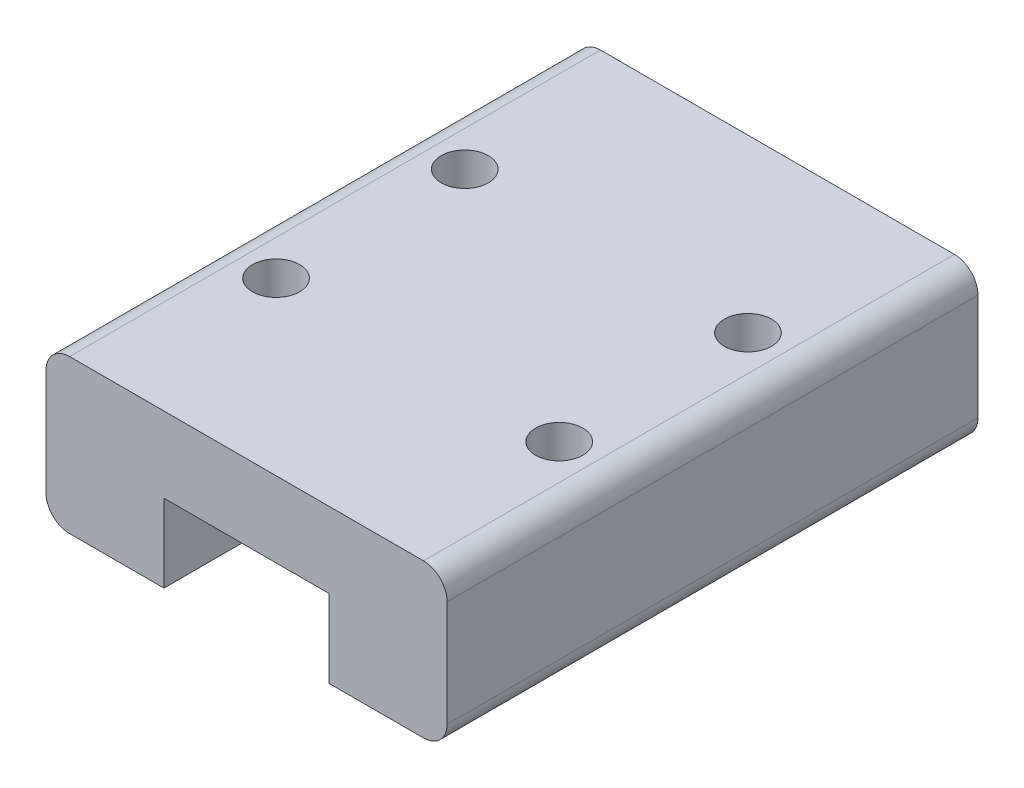
ISO-10303-21;
HEADER;
FILE_DESCRIPTION(('STEP AP214'),'2;1');
FILE_NAME('part.step','',(''),(''),'','','');
FILE_SCHEMA(('AUTOMOTIVE_DESIGN { 1 0 10303 214 1 1 1 1 }'));
ENDSEC;
DATA;
#1=APPLICATION_CONTEXT('core data for automotive mechanical design processes');
#2=APPLICATION_PROTOCOL_DEFINITION('international standard','automotive_design',2000,#1);
#3=PRODUCT_CONTEXT('',#1,'mechanical');
#4=PRODUCT('Part','Part','',(#3));
#5=PRODUCT_RELATED_PRODUCT_CATEGORY('part','',(#4));
#6=PRODUCT_DEFINITION_FORMATION('','',#4);
#7=PRODUCT_DEFINITION_CONTEXT('part definition',#1,'design');
#8=PRODUCT_DEFINITION('design','',#6,#7);
#9=PRODUCT_DEFINITION_SHAPE('','',#8);
#10=(LENGTH_UNIT() NAMED_UNIT(*) SI_UNIT(.MILLI.,.METRE.));
#11=(NAMED_UNIT(*) PLANE_ANGLE_UNIT() SI_UNIT($,.RADIAN.));
#12=(NAMED_UNIT(*) SI_UNIT($,.STERADIAN.) SOLID_ANGLE_UNIT());
#13=UNCERTAINTY_MEASURE_WITH_UNIT(LENGTH_MEASURE(1.E-05),#10,'distance_accuracy_value','');
#14=(GEOMETRIC_REPRESENTATION_CONTEXT(3) GLOBAL_UNCERTAINTY_ASSIGNED_CONTEXT((#13)) GLOBAL_UNIT_ASSIGNED_CONTEXT((#10,
#11,#12)) REPRESENTATION_CONTEXT('',''));
#15=CARTESIAN_POINT('',(0.,0.,0.));
#16=DIRECTION('',(0.,0.,1.));
#17=DIRECTION('',(1.,0.,0.));
#18=AXIS2_PLACEMENT_3D('',#15,#16,#17);
#19=CARTESIAN_POINT('',(5.,0.,22.5));
#20=DIRECTION('',(-1.,0.,0.));
#21=DIRECTION('',(0.,0.,1.));
#22=AXIS2_PLACEMENT_3D('',#19,#20,#21);
#23=PLANE('',#22);
#24=DIRECTION('',(0.,1.,0.));
#25=VECTOR('',#24,1.);
#26=CARTESIAN_POINT('',(5.,0.,0.));
#27=LINE('',#26,#25);
#28=CARTESIAN_POINT('',(5.,0.,0.));
#29=VERTEX_POINT('',#28);
#30=CARTESIAN_POINT('',(5.,3.3,0.));
#31=VERTEX_POINT('',#30);
#32=EDGE_CURVE('E154',#29,#31,#27,.T.);
#33=ORIENTED_EDGE('',*,*,#32,.T.);
#34=DIRECTION('',(0.,0.,-1.));
#35=VECTOR('',#34,1.);
#36=CARTESIAN_POINT('',(5.,3.3,22.5));
#37=LINE('',#36,#35);
#38=CARTESIAN_POINT('',(5.,3.3,22.5));
#39=VERTEX_POINT('',#38);
#40=EDGE_CURVE('E11',#39,#31,#37,.T.);
#41=ORIENTED_EDGE('',*,*,#40,.F.);
#42=DIRECTION('',(0.,1.,0.));
#43=VECTOR('',#42,1.);
#44=CARTESIAN_POINT('',(5.,0.,22.5));
#45=LINE('',#44,#43);
#46=CARTESIAN_POINT('',(5.,0.,22.5));
#47=VERTEX_POINT('',#46);
#48=EDGE_CURVE('E177',#47,#39,#45,.T.);
#49=ORIENTED_EDGE('',*,*,#48,.F.);
#50=DIRECTION('',(0.,0.,-1.));
#51=VECTOR('',#50,1.);
#52=CARTESIAN_POINT('',(5.,0.,22.5));
#53=LINE('',#52,#51);
#54=EDGE_CURVE('E150',#47,#29,#53,.T.);
#55=ORIENTED_EDGE('',*,*,#54,.T.);
#56=EDGE_LOOP('',(#33,#41,#49,#55));
#57=FACE_BOUND('',#56,.T.);
#58=ADVANCED_FACE('F34',(#57),#23,.F.);
#59=CARTESIAN_POINT('',(5.,3.3,22.5));
#60=DIRECTION('',(0.,1.,0.));
#61=DIRECTION('',(0.,0.,1.));
#62=AXIS2_PLACEMENT_3D('',#59,#60,#61);
#63=PLANE('',#62);
#64=DIRECTION('',(1.,0.,0.));
#65=VECTOR('',#64,1.);
#66=CARTESIAN_POINT('',(5.,3.3,0.));
#67=LINE('',#66,#65);
#68=CARTESIAN_POINT('',(12.,3.3,0.));
#69=VERTEX_POINT('',#68);
#70=EDGE_CURVE('E157',#31,#69,#67,.T.);
#71=ORIENTED_EDGE('',*,*,#70,.T.);
#72=DIRECTION('',(0.,0.,-1.));
#73=VECTOR('',#72,1.);
#74=CARTESIAN_POINT('',(12.,3.3,22.5));
#75=LINE('',#74,#73);
#76=CARTESIAN_POINT('',(12.,3.3,22.5));
#77=VERTEX_POINT('',#76);
#78=EDGE_CURVE('E42',#77,#69,#75,.T.);
#79=ORIENTED_EDGE('',*,*,#78,.F.);
#80=DIRECTION('',(1.,0.,0.));
#81=VECTOR('',#80,1.);
#82=CARTESIAN_POINT('',(5.,3.3,22.5));
#83=LINE('',#82,#81);
#84=EDGE_CURVE('E105',#39,#77,#83,.T.);
#85=ORIENTED_EDGE('',*,*,#84,.F.);
#86=ORIENTED_EDGE('',*,*,#40,.T.);
#87=EDGE_LOOP('',(#71,#79,#85,#86));
#88=FACE_BOUND('',#87,.T.);
#89=ADVANCED_FACE('F255',(#88),#63,.F.);
#90=CARTESIAN_POINT('',(12.,0.,22.5));
#91=DIRECTION('',(1.,0.,0.));
#92=DIRECTION('',(0.,0.,-1.));
#93=AXIS2_PLACEMENT_3D('',#90,#91,#92);
#94=PLANE('',#93);
#95=DIRECTION('',(0.,-1.,0.));
#96=VECTOR('',#95,1.);
#97=CARTESIAN_POINT('',(12.,0.,0.));
#98=LINE('',#97,#96);
#99=CARTESIAN_POINT('',(12.,0.,0.));
#100=VERTEX_POINT('',#99);
#101=EDGE_CURVE('E160',#69,#100,#98,.T.);
#102=ORIENTED_EDGE('',*,*,#101,.T.);
#103=DIRECTION('',(0.,0.,-1.));
#104=VECTOR('',#103,1.);
#105=CARTESIAN_POINT('',(12.,0.,22.5));
#106=LINE('',#105,#104);
#107=CARTESIAN_POINT('',(12.,0.,22.5));
#108=VERTEX_POINT('',#107);
#109=EDGE_CURVE('E196',#108,#100,#106,.T.);
#110=ORIENTED_EDGE('',*,*,#109,.F.);
#111=DIRECTION('',(0.,-1.,0.));
#112=VECTOR('',#111,1.);
#113=CARTESIAN_POINT('',(12.,0.,22.5));
#114=LINE('',#113,#112);
#115=EDGE_CURVE('E204',#77,#108,#114,.T.);
#116=ORIENTED_EDGE('',*,*,#115,.F.);
#117=ORIENTED_EDGE('',*,*,#78,.T.);
#118=EDGE_LOOP('',(#102,#110,#116,#117));
#119=FACE_BOUND('',#118,.T.);
#120=ADVANCED_FACE('F202',(#119),#94,.F.);
#121=CARTESIAN_POINT('',(12.,0.,22.5));
#122=DIRECTION('',(0.,1.,0.));
#123=DIRECTION('',(0.,0.,1.));
#124=AXIS2_PLACEMENT_3D('',#121,#122,#123);
#125=PLANE('',#124);
#126=DIRECTION('',(1.,0.,0.));
#127=VECTOR('',#126,1.);
#128=CARTESIAN_POINT('',(12.,0.,0.));
#129=LINE('',#128,#127);
#130=CARTESIAN_POINT('',(16.,0.,0.));
#131=VERTEX_POINT('',#130);
#132=EDGE_CURVE('E162',#100,#131,#129,.T.);
#133=ORIENTED_EDGE('',*,*,#132,.T.);
#134=DIRECTION('',(0.,0.,-1.));
#135=VECTOR('',#134,1.);
#136=CARTESIAN_POINT('',(16.,0.,22.5));
#137=LINE('',#136,#135);
#138=CARTESIAN_POINT('',(16.,0.,22.5));
#139=VERTEX_POINT('',#138);
#140=EDGE_CURVE('E193',#139,#131,#137,.T.);
#141=ORIENTED_EDGE('',*,*,#140,.F.);
#142=DIRECTION('',(1.,0.,0.));
#143=VECTOR('',#142,1.);
#144=CARTESIAN_POINT('',(12.,0.,22.5));
#145=LINE('',#144,#143);
#146=EDGE_CURVE('E222',#108,#139,#145,.T.);
#147=ORIENTED_EDGE('',*,*,#146,.F.);
#148=ORIENTED_EDGE('',*,*,#109,.T.);
#149=EDGE_LOOP('',(#133,#141,#147,#148));
#150=FACE_BOUND('',#149,.T.);
#151=ADVANCED_FACE('F213',(#150),#125,.F.);
#152=CARTESIAN_POINT('',(16.,1.,22.5));
#153=DIRECTION('',(0.,0.,-1.));
#154=DIRECTION('',(-1.,0.,0.));
#155=AXIS2_PLACEMENT_3D('',#152,#153,#154);
#156=CYLINDRICAL_SURFACE('',#155,1.);
#157=CARTESIAN_POINT('',(16.,1.,0.));
#158=DIRECTION('',(0.,0.,1.));
#159=DIRECTION('',(1.,0.,0.));
#160=AXIS2_PLACEMENT_3D('',#157,#158,#159);
#161=CIRCLE('',#160,1.);
#162=CARTESIAN_POINT('',(17.,1.00000000000001,0.));
#163=VERTEX_POINT('',#162);
#164=EDGE_CURVE('E164',#131,#163,#161,.T.);
#165=ORIENTED_EDGE('',*,*,#164,.T.);
#166=DIRECTION('',(0.,0.,-1.));
#167=VECTOR('',#166,1.);
#168=CARTESIAN_POINT('',(17.,1.00000000000001,22.5));
#169=LINE('',#168,#167);
#170=CARTESIAN_POINT('',(17.,1.00000000000001,22.5));
#171=VERTEX_POINT('',#170);
#172=EDGE_CURVE('E190',#171,#163,#169,.T.);
#173=ORIENTED_EDGE('',*,*,#172,.F.);
#174=CARTESIAN_POINT('',(16.,1.,22.5));
#175=DIRECTION('',(0.,0.,1.));
#176=DIRECTION('',(1.,0.,0.));
#177=AXIS2_PLACEMENT_3D('',#174,#175,#176);
#178=CIRCLE('',#177,1.);
#179=EDGE_CURVE('E219',#139,#171,#178,.T.);
#180=ORIENTED_EDGE('',*,*,#179,.F.);
#181=ORIENTED_EDGE('',*,*,#140,.T.);
#182=EDGE_LOOP('',(#165,#173,#180,#181));
#183=FACE_BOUND('',#182,.T.);
#184=ADVANCED_FACE('F217',(#183),#156,.T.);
#185=CARTESIAN_POINT('',(17.,1.00000000000001,22.5));
#186=DIRECTION('',(-1.,0.,0.));
#187=DIRECTION('',(0.,0.,1.));
#188=AXIS2_PLACEMENT_3D('',#185,#186,#187);
#189=PLANE('',#188);
#190=DIRECTION('',(0.,1.,0.));
#191=VECTOR('',#190,1.);
#192=CARTESIAN_POINT('',(17.,1.00000000000001,0.));
#193=LINE('',#192,#191);
#194=CARTESIAN_POINT('',(17.,5.49999999999999,0.));
#195=VERTEX_POINT('',#194);
#196=EDGE_CURVE('E166',#163,#195,#193,.T.);
#197=ORIENTED_EDGE('',*,*,#196,.T.);
#198=DIRECTION('',(0.,0.,-1.));
#199=VECTOR('',#198,1.);
#200=CARTESIAN_POINT('',(17.,5.49999999999999,22.5));
#201=LINE('',#200,#199);
#202=CARTESIAN_POINT('',(17.,5.49999999999999,22.5));
#203=VERTEX_POINT('',#202);
#204=EDGE_CURVE('E187',#203,#195,#201,.T.);
#205=ORIENTED_EDGE('',*,*,#204,.F.);
#206=DIRECTION('',(0.,1.,0.));
#207=VECTOR('',#206,1.);
#208=CARTESIAN_POINT('',(17.,1.00000000000001,22.5));
#209=LINE('',#208,#207);
#210=EDGE_CURVE('E221',#171,#203,#209,.T.);
#211=ORIENTED_EDGE('',*,*,#210,.F.);
#212=ORIENTED_EDGE('',*,*,#172,.T.);
#213=EDGE_LOOP('',(#197,#205,#211,#212));
#214=FACE_BOUND('',#213,.T.);
#215=ADVANCED_FACE('F268',(#214),#189,.F.);
#216=CARTESIAN_POINT('',(16.,5.5,22.5));
#217=DIRECTION('',(0.,0.,-1.));
#218=DIRECTION('',(-1.,0.,0.));
#219=AXIS2_PLACEMENT_3D('',#216,#217,#218);
#220=CYLINDRICAL_SURFACE('',#219,1.);
#221=CARTESIAN_POINT('',(16.,5.5,0.));
#222=DIRECTION('',(0.,0.,1.));
#223=DIRECTION('',(-1.,0.,0.));
#224=AXIS2_PLACEMENT_3D('',#221,#222,#223);
#225=CIRCLE('',#224,1.);
#226=CARTESIAN_POINT('',(16.,6.5,0.));
#227=VERTEX_POINT('',#226);
#228=EDGE_CURVE('E168',#195,#227,#225,.T.);
#229=ORIENTED_EDGE('',*,*,#228,.T.);
#230=DIRECTION('',(0.,0.,-1.));
#231=VECTOR('',#230,1.);
#232=CARTESIAN_POINT('',(16.,6.5,22.5));
#233=LINE('',#232,#231);
#234=CARTESIAN_POINT('',(16.,6.5,22.5));
#235=VERTEX_POINT('',#234);
#236=EDGE_CURVE('E184',#235,#227,#233,.T.);
#237=ORIENTED_EDGE('',*,*,#236,.F.);
#238=CARTESIAN_POINT('',(16.,5.5,22.5));
#239=DIRECTION('',(0.,0.,1.));
#240=DIRECTION('',(-1.,0.,0.));
#241=AXIS2_PLACEMENT_3D('',#238,#239,#240);
#242=CIRCLE('',#241,1.);
#243=EDGE_CURVE('E224',#203,#235,#242,.T.);
#244=ORIENTED_EDGE('',*,*,#243,.F.);
#245=ORIENTED_EDGE('',*,*,#204,.T.);
#246=EDGE_LOOP('',(#229,#237,#244,#245));
#247=FACE_BOUND('',#246,.T.);
#248=ADVANCED_FACE('F271',(#247),#220,.T.);
#249=CARTESIAN_POINT('',(1.00000000000001,6.5,22.5));
#250=DIRECTION('',(0.,-1.,0.));
#251=DIRECTION('',(0.,0.,-1.));
#252=AXIS2_PLACEMENT_3D('',#249,#250,#251);
#253=PLANE('',#252);
#254=CARTESIAN_POINT('',(14.5,6.5,15.25));
#255=DIRECTION('',(0.,1.,0.));
#256=DIRECTION('',(0.,0.,-1.));
#257=AXIS2_PLACEMENT_3D('',#254,#255,#256);
#258=CIRCLE('',#257,1.);
#259=CARTESIAN_POINT('',(14.5,6.5,14.25));
#260=VERTEX_POINT('',#259);
#261=EDGE_CURVE('E403',#260,#260,#258,.T.);
#262=ORIENTED_EDGE('',*,*,#261,.F.);
#263=EDGE_LOOP('',(#262));
#264=FACE_BOUND('',#263,.T.);
#265=CARTESIAN_POINT('',(14.5,6.5,7.25));
#266=DIRECTION('',(0.,1.,0.));
#267=DIRECTION('',(0.,0.,1.));
#268=AXIS2_PLACEMENT_3D('',#265,#266,#267);
#269=CIRCLE('',#268,1.);
#270=CARTESIAN_POINT('',(14.5,6.5,8.25));
#271=VERTEX_POINT('',#270);
#272=EDGE_CURVE('E402',#271,#271,#269,.T.);
#273=ORIENTED_EDGE('',*,*,#272,.F.);
#274=EDGE_LOOP('',(#273));
#275=FACE_BOUND('',#274,.T.);
#276=CARTESIAN_POINT('',(2.5,6.5,7.25));
#277=DIRECTION('',(0.,1.,0.));
#278=DIRECTION('',(0.,0.,-1.));
#279=AXIS2_PLACEMENT_3D('',#276,#277,#278);
#280=CIRCLE('',#279,1.);
#281=CARTESIAN_POINT('',(2.5,6.5,6.25));
#282=VERTEX_POINT('',#281);
#283=EDGE_CURVE('E422',#282,#282,#280,.T.);
#284=ORIENTED_EDGE('',*,*,#283,.F.);
#285=EDGE_LOOP('',(#284));
#286=FACE_BOUND('',#285,.T.);
#287=CARTESIAN_POINT('',(2.50000000000001,6.5,15.25));
#288=DIRECTION('',(0.,1.,0.));
#289=DIRECTION('',(0.,0.,1.));
#290=AXIS2_PLACEMENT_3D('',#287,#288,#289);
#291=CIRCLE('',#290,1.);
#292=CARTESIAN_POINT('',(2.50000000000001,6.5,16.25));
#293=VERTEX_POINT('',#292);
#294=EDGE_CURVE('E414',#293,#293,#291,.T.);
#295=ORIENTED_EDGE('',*,*,#294,.F.);
#296=EDGE_LOOP('',(#295));
#297=FACE_BOUND('',#296,.T.);
#298=DIRECTION('',(-1.,0.,0.));
#299=VECTOR('',#298,1.);
#300=CARTESIAN_POINT('',(1.00000000000001,6.5,0.));
#301=LINE('',#300,#299);
#302=CARTESIAN_POINT('',(1.00000000000001,6.5,0.));
#303=VERTEX_POINT('',#302);
#304=EDGE_CURVE('E170',#227,#303,#301,.T.);
#305=ORIENTED_EDGE('',*,*,#304,.T.);
#306=DIRECTION('',(0.,0.,-1.));
#307=VECTOR('',#306,1.);
#308=CARTESIAN_POINT('',(1.00000000000001,6.5,22.5));
#309=LINE('',#308,#307);
#310=CARTESIAN_POINT('',(1.00000000000001,6.5,22.5));
#311=VERTEX_POINT('',#310);
#312=EDGE_CURVE('E181',#311,#303,#309,.T.);
#313=ORIENTED_EDGE('',*,*,#312,.F.);
#314=DIRECTION('',(-1.,0.,0.));
#315=VECTOR('',#314,1.);
#316=CARTESIAN_POINT('',(1.00000000000001,6.5,22.5));
#317=LINE('',#316,#315);
#318=EDGE_CURVE('E230',#235,#311,#317,.T.);
#319=ORIENTED_EDGE('',*,*,#318,.F.);
#320=ORIENTED_EDGE('',*,*,#236,.T.);
#321=EDGE_LOOP('',(#305,#313,#319,#320));
#322=FACE_BOUND('',#321,.T.);
#323=ADVANCED_FACE('F236',(#264,#275,#286,#297,#322),#253,.F.);
#324=CARTESIAN_POINT('',(1.,5.5,22.5));
#325=DIRECTION('',(0.,0.,-1.));
#326=DIRECTION('',(-1.,0.,0.));
#327=AXIS2_PLACEMENT_3D('',#324,#325,#326);
#328=CYLINDRICAL_SURFACE('',#327,1.);
#329=CARTESIAN_POINT('',(1.,5.5,0.));
#330=DIRECTION('',(0.,0.,1.));
#331=DIRECTION('',(-1.,0.,0.));
#332=AXIS2_PLACEMENT_3D('',#329,#330,#331);
#333=CIRCLE('',#332,1.);
#334=CARTESIAN_POINT('',(0.,5.49999999999999,0.));
#335=VERTEX_POINT('',#334);
#336=EDGE_CURVE('E172',#303,#335,#333,.T.);
#337=ORIENTED_EDGE('',*,*,#336,.T.);
#338=DIRECTION('',(0.,0.,-1.));
#339=VECTOR('',#338,1.);
#340=CARTESIAN_POINT('',(0.,5.49999999999999,22.5));
#341=LINE('',#340,#339);
#342=CARTESIAN_POINT('',(0.,5.49999999999999,22.5));
#343=VERTEX_POINT('',#342);
#344=EDGE_CURVE('E145',#343,#335,#341,.T.);
#345=ORIENTED_EDGE('',*,*,#344,.F.);
#346=CARTESIAN_POINT('',(1.,5.5,22.5));
#347=DIRECTION('',(0.,0.,1.));
#348=DIRECTION('',(-1.,0.,0.));
#349=AXIS2_PLACEMENT_3D('',#346,#347,#348);
#350=CIRCLE('',#349,1.);
#351=EDGE_CURVE('E136',#311,#343,#350,.T.);
#352=ORIENTED_EDGE('',*,*,#351,.F.);
#353=ORIENTED_EDGE('',*,*,#312,.T.);
#354=EDGE_LOOP('',(#337,#345,#352,#353));
#355=FACE_BOUND('',#354,.T.);
#356=ADVANCED_FACE('F240',(#355),#328,.T.);
#357=CARTESIAN_POINT('',(0.,1.00000000000001,22.5));
#358=DIRECTION('',(1.,0.,0.));
#359=DIRECTION('',(0.,0.,-1.));
#360=AXIS2_PLACEMENT_3D('',#357,#358,#359);
#361=PLANE('',#360);
#362=DIRECTION('',(0.,-1.,0.));
#363=VECTOR('',#362,1.);
#364=CARTESIAN_POINT('',(0.,1.00000000000001,0.));
#365=LINE('',#364,#363);
#366=CARTESIAN_POINT('',(0.,1.,0.));
#367=VERTEX_POINT('',#366);
#368=EDGE_CURVE('E144',#335,#367,#365,.T.);
#369=ORIENTED_EDGE('',*,*,#368,.T.);
#370=DIRECTION('',(0.,0.,-1.));
#371=VECTOR('',#370,1.);
#372=CARTESIAN_POINT('',(0.,1.,22.5));
#373=LINE('',#372,#371);
#374=CARTESIAN_POINT('',(0.,1.,22.5));
#375=VERTEX_POINT('',#374);
#376=EDGE_CURVE('E141',#375,#367,#373,.T.);
#377=ORIENTED_EDGE('',*,*,#376,.F.);
#378=DIRECTION('',(0.,-1.,0.));
#379=VECTOR('',#378,1.);
#380=CARTESIAN_POINT('',(0.,1.00000000000001,22.5));
#381=LINE('',#380,#379);
#382=EDGE_CURVE('E130',#343,#375,#381,.T.);
#383=ORIENTED_EDGE('',*,*,#382,.F.);
#384=ORIENTED_EDGE('',*,*,#344,.T.);
#385=EDGE_LOOP('',(#369,#377,#383,#384));
#386=FACE_BOUND('',#385,.T.);
#387=ADVANCED_FACE('F142',(#386),#361,.F.);
#388=CARTESIAN_POINT('',(1.,1.,22.5));
#389=DIRECTION('',(0.,0.,-1.));
#390=DIRECTION('',(-1.,0.,0.));
#391=AXIS2_PLACEMENT_3D('',#388,#389,#390);
#392=CYLINDRICAL_SURFACE('',#391,1.);
#393=CARTESIAN_POINT('',(1.,1.,0.));
#394=DIRECTION('',(0.,0.,1.));
#395=DIRECTION('',(-1.,0.,0.));
#396=AXIS2_PLACEMENT_3D('',#393,#394,#395);
#397=CIRCLE('',#396,1.);
#398=CARTESIAN_POINT('',(1.00000000000001,0.,0.));
#399=VERTEX_POINT('',#398);
#400=EDGE_CURVE('E91',#367,#399,#397,.T.);
#401=ORIENTED_EDGE('',*,*,#400,.T.);
#402=DIRECTION('',(0.,0.,-1.));
#403=VECTOR('',#402,1.);
#404=CARTESIAN_POINT('',(1.00000000000001,0.,22.5));
#405=LINE('',#404,#403);
#406=CARTESIAN_POINT('',(1.00000000000001,0.,22.5));
#407=VERTEX_POINT('',#406);
#408=EDGE_CURVE('E146',#407,#399,#405,.T.);
#409=ORIENTED_EDGE('',*,*,#408,.F.);
#410=CARTESIAN_POINT('',(1.,1.,22.5));
#411=DIRECTION('',(0.,0.,1.));
#412=DIRECTION('',(-1.,0.,0.));
#413=AXIS2_PLACEMENT_3D('',#410,#411,#412);
#414=CIRCLE('',#413,1.);
#415=EDGE_CURVE('E134',#375,#407,#414,.T.);
#416=ORIENTED_EDGE('',*,*,#415,.F.);
#417=ORIENTED_EDGE('',*,*,#376,.T.);
#418=EDGE_LOOP('',(#401,#409,#416,#417));
#419=FACE_BOUND('',#418,.T.);
#420=ADVANCED_FACE('F148',(#419),#392,.T.);
#421=CARTESIAN_POINT('',(1.00000000000001,0.,22.5));
#422=DIRECTION('',(0.,1.,0.));
#423=DIRECTION('',(0.,0.,1.));
#424=AXIS2_PLACEMENT_3D('',#421,#422,#423);
#425=PLANE('',#424);
#426=DIRECTION('',(1.,0.,0.));
#427=VECTOR('',#426,1.);
#428=CARTESIAN_POINT('',(1.00000000000001,0.,0.));
#429=LINE('',#428,#427);
#430=EDGE_CURVE('E97',#399,#29,#429,.T.);
#431=ORIENTED_EDGE('',*,*,#430,.T.);
#432=ORIENTED_EDGE('',*,*,#54,.F.);
#433=DIRECTION('',(1.,0.,0.));
#434=VECTOR('',#433,1.);
#435=CARTESIAN_POINT('',(1.00000000000001,0.,22.5));
#436=LINE('',#435,#434);
#437=EDGE_CURVE('E50',#407,#47,#436,.T.);
#438=ORIENTED_EDGE('',*,*,#437,.F.);
#439=ORIENTED_EDGE('',*,*,#408,.T.);
#440=EDGE_LOOP('',(#431,#432,#438,#439));
#441=FACE_BOUND('',#440,.T.);
#442=ADVANCED_FACE('F244',(#441),#425,.F.);
#443=CARTESIAN_POINT('',(16.,1.,22.5));
#444=DIRECTION('',(0.,0.,1.));
#445=DIRECTION('',(1.,0.,0.));
#446=AXIS2_PLACEMENT_3D('',#443,#444,#445);
#447=PLANE('',#446);
#448=ORIENTED_EDGE('',*,*,#48,.T.);
#449=ORIENTED_EDGE('',*,*,#84,.T.);
#450=ORIENTED_EDGE('',*,*,#115,.T.);
#451=ORIENTED_EDGE('',*,*,#146,.T.);
#452=ORIENTED_EDGE('',*,*,#179,.T.);
#453=ORIENTED_EDGE('',*,*,#210,.T.);
#454=ORIENTED_EDGE('',*,*,#243,.T.);
#455=ORIENTED_EDGE('',*,*,#318,.T.);
#456=ORIENTED_EDGE('',*,*,#351,.T.);
#457=ORIENTED_EDGE('',*,*,#382,.T.);
#458=ORIENTED_EDGE('',*,*,#415,.T.);
#459=ORIENTED_EDGE('',*,*,#437,.T.);
#460=EDGE_LOOP('',(#448,#449,#450,#451,#452,#453,#454,#455,#456,#457,#458,#459));
#461=FACE_BOUND('',#460,.T.);
#462=ADVANCED_FACE('F132',(#461),#447,.T.);
#463=CARTESIAN_POINT('',(16.,1.,0.));
#464=DIRECTION('',(0.,0.,1.));
#465=DIRECTION('',(1.,0.,0.));
#466=AXIS2_PLACEMENT_3D('',#463,#464,#465);
#467=PLANE('',#466);
#468=ORIENTED_EDGE('',*,*,#32,.F.);
#469=ORIENTED_EDGE('',*,*,#430,.F.);
#470=ORIENTED_EDGE('',*,*,#400,.F.);
#471=ORIENTED_EDGE('',*,*,#368,.F.);
#472=ORIENTED_EDGE('',*,*,#336,.F.);
#473=ORIENTED_EDGE('',*,*,#304,.F.);
#474=ORIENTED_EDGE('',*,*,#228,.F.);
#475=ORIENTED_EDGE('',*,*,#196,.F.);
#476=ORIENTED_EDGE('',*,*,#164,.F.);
#477=ORIENTED_EDGE('',*,*,#132,.F.);
#478=ORIENTED_EDGE('',*,*,#101,.F.);
#479=ORIENTED_EDGE('',*,*,#70,.F.);
#480=EDGE_LOOP('',(#468,#469,#470,#471,#472,#473,#474,#475,#476,#477,#478,#479));
#481=FACE_BOUND('',#480,.T.);
#482=ADVANCED_FACE('F208',(#481),#467,.F.);
#483=CARTESIAN_POINT('',(2.50000000000001,4.,15.25));
#484=DIRECTION('',(0.,1.,0.));
#485=DIRECTION('',(0.,0.,1.));
#486=AXIS2_PLACEMENT_3D('',#483,#484,#485);
#487=CYLINDRICAL_SURFACE('',#486,1.);
#488=CARTESIAN_POINT('',(2.50000000000001,4.,15.25));
#489=DIRECTION('',(0.,1.,0.));
#490=DIRECTION('',(0.,0.,1.));
#491=AXIS2_PLACEMENT_3D('',#488,#489,#490);
#492=CIRCLE('',#491,1.);
#493=CARTESIAN_POINT('',(2.50000000000001,4.,16.25));
#494=VERTEX_POINT('',#493);
#495=EDGE_CURVE('E158',#494,#494,#492,.T.);
#496=ORIENTED_EDGE('',*,*,#495,.F.);
#497=EDGE_LOOP('',(#496));
#498=FACE_BOUND('',#497,.T.);
#499=ORIENTED_EDGE('',*,*,#294,.T.);
#500=EDGE_LOOP('',(#499));
#501=FACE_BOUND('',#500,.T.);
#502=ADVANCED_FACE('F309',(#498,#501),#487,.F.);
#503=CARTESIAN_POINT('',(2.50000000000001,4.,15.25));
#504=DIRECTION('',(0.,1.,0.));
#505=DIRECTION('',(0.,0.,1.));
#506=AXIS2_PLACEMENT_3D('',#503,#504,#505);
#507=PLANE('',#506);
#508=ORIENTED_EDGE('',*,*,#495,.T.);
#509=EDGE_LOOP('',(#508));
#510=FACE_BOUND('',#509,.T.);
#511=ADVANCED_FACE('F325',(#510),#507,.T.);
#512=CARTESIAN_POINT('',(2.5,4.,7.25));
#513=DIRECTION('',(0.,1.,0.));
#514=DIRECTION('',(0.,0.,1.));
#515=AXIS2_PLACEMENT_3D('',#512,#513,#514);
#516=CYLINDRICAL_SURFACE('',#515,1.);
#517=CARTESIAN_POINT('',(2.5,4.,7.25));
#518=DIRECTION('',(0.,1.,0.));
#519=DIRECTION('',(0.,0.,-1.));
#520=AXIS2_PLACEMENT_3D('',#517,#518,#519);
#521=CIRCLE('',#520,1.);
#522=CARTESIAN_POINT('',(2.5,4.,6.25));
#523=VERTEX_POINT('',#522);
#524=EDGE_CURVE('E417',#523,#523,#521,.T.);
#525=ORIENTED_EDGE('',*,*,#524,.F.);
#526=EDGE_LOOP('',(#525));
#527=FACE_BOUND('',#526,.T.);
#528=ORIENTED_EDGE('',*,*,#283,.T.);
#529=EDGE_LOOP('',(#528));
#530=FACE_BOUND('',#529,.T.);
#531=ADVANCED_FACE('F335',(#527,#530),#516,.F.);
#532=CARTESIAN_POINT('',(2.5,4.,7.25));
#533=DIRECTION('',(0.,-1.,0.));
#534=DIRECTION('',(0.,0.,-1.));
#535=AXIS2_PLACEMENT_3D('',#532,#533,#534);
#536=PLANE('',#535);
#537=ORIENTED_EDGE('',*,*,#524,.T.);
#538=EDGE_LOOP('',(#537));
#539=FACE_BOUND('',#538,.T.);
#540=ADVANCED_FACE('F345',(#539),#536,.F.);
#541=CARTESIAN_POINT('',(14.5,4.,7.25));
#542=DIRECTION('',(0.,1.,0.));
#543=DIRECTION('',(0.,0.,1.));
#544=AXIS2_PLACEMENT_3D('',#541,#542,#543);
#545=CYLINDRICAL_SURFACE('',#544,1.);
#546=CARTESIAN_POINT('',(14.5,4.,7.25));
#547=DIRECTION('',(0.,1.,0.));
#548=DIRECTION('',(0.,0.,1.));
#549=AXIS2_PLACEMENT_3D('',#546,#547,#548);
#550=CIRCLE('',#549,1.);
#551=CARTESIAN_POINT('',(14.5,4.,8.25));
#552=VERTEX_POINT('',#551);
#553=EDGE_CURVE('E406',#552,#552,#550,.T.);
#554=ORIENTED_EDGE('',*,*,#553,.F.);
#555=EDGE_LOOP('',(#554));
#556=FACE_BOUND('',#555,.T.);
#557=ORIENTED_EDGE('',*,*,#272,.T.);
#558=EDGE_LOOP('',(#557));
#559=FACE_BOUND('',#558,.T.);
#560=ADVANCED_FACE('F355',(#556,#559),#545,.F.);
#561=CARTESIAN_POINT('',(14.5,4.,7.25));
#562=DIRECTION('',(0.,1.,0.));
#563=DIRECTION('',(0.,0.,1.));
#564=AXIS2_PLACEMENT_3D('',#561,#562,#563);
#565=PLANE('',#564);
#566=ORIENTED_EDGE('',*,*,#553,.T.);
#567=EDGE_LOOP('',(#566));
#568=FACE_BOUND('',#567,.T.);
#569=ADVANCED_FACE('F365',(#568),#565,.T.);
#570=CARTESIAN_POINT('',(14.5,4.,15.25));
#571=DIRECTION('',(0.,1.,0.));
#572=DIRECTION('',(0.,0.,1.));
#573=AXIS2_PLACEMENT_3D('',#570,#571,#572);
#574=CYLINDRICAL_SURFACE('',#573,1.);
#575=CARTESIAN_POINT('',(14.5,4.,15.25));
#576=DIRECTION('',(0.,1.,0.));
#577=DIRECTION('',(0.,0.,-1.));
#578=AXIS2_PLACEMENT_3D('',#575,#576,#577);
#579=CIRCLE('',#578,1.);
#580=CARTESIAN_POINT('',(14.5,4.,14.25));
#581=VERTEX_POINT('',#580);
#582=EDGE_CURVE('E401',#581,#581,#579,.T.);
#583=ORIENTED_EDGE('',*,*,#582,.F.);
#584=EDGE_LOOP('',(#583));
#585=FACE_BOUND('',#584,.T.);
#586=ORIENTED_EDGE('',*,*,#261,.T.);
#587=EDGE_LOOP('',(#586));
#588=FACE_BOUND('',#587,.T.);
#589=ADVANCED_FACE('F375',(#585,#588),#574,.F.);
#590=CARTESIAN_POINT('',(14.5,4.,15.25));
#591=DIRECTION('',(0.,-1.,0.));
#592=DIRECTION('',(0.,0.,-1.));
#593=AXIS2_PLACEMENT_3D('',#590,#591,#592);
#594=PLANE('',#593);
#595=ORIENTED_EDGE('',*,*,#582,.T.);
#596=EDGE_LOOP('',(#595));
#597=FACE_BOUND('',#596,.T.);
#598=ADVANCED_FACE('F385',(#597),#594,.F.);
#599=CLOSED_SHELL('',(#58,#89,#120,#151,#184,#215,#248,#323,#356,#387,#420,#442,#462,#482,#502,
#511,#531,#540,#560,#569,#589,#598));
#600=MANIFOLD_SOLID_BREP('B2',#599);
#601=ADVANCED_BREP_SHAPE_REPRESENTATION('',(#18,#600),#14);
#602=SHAPE_DEFINITION_REPRESENTATION(#9,#601);
ENDSEC;
END-ISO-10303-21;
